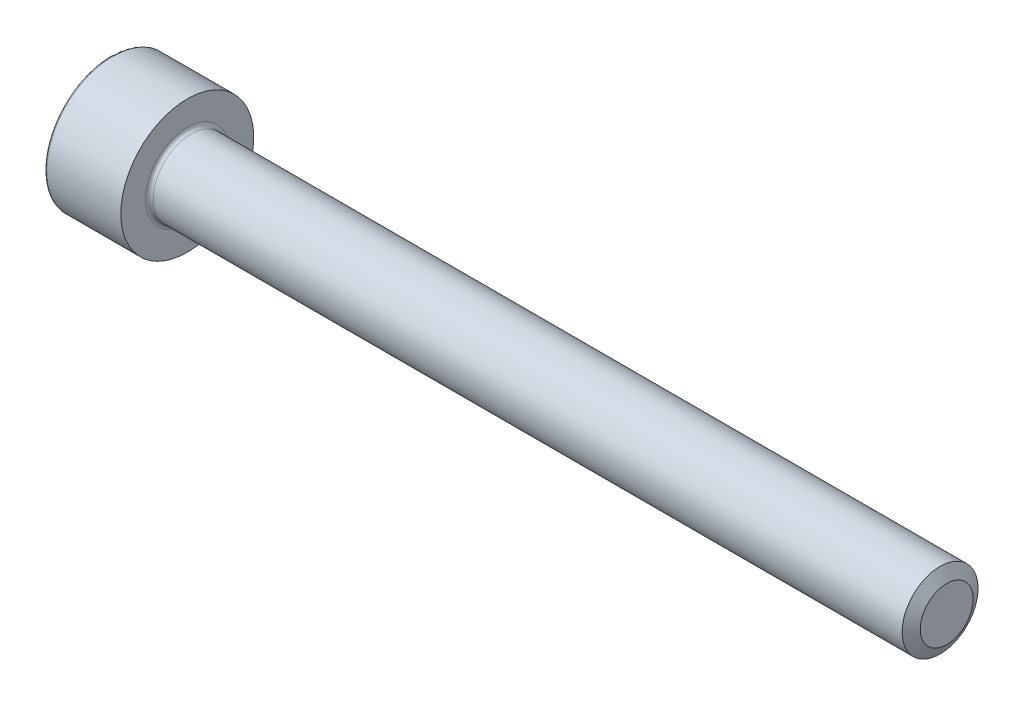
ISO-10303-21;
HEADER;
FILE_DESCRIPTION(('STEP AP214'),'2;1');
FILE_NAME('part.step','',(''),(''),'','','');
FILE_SCHEMA(('AUTOMOTIVE_DESIGN { 1 0 10303 214 1 1 1 1 }'));
ENDSEC;
DATA;
#1=APPLICATION_CONTEXT('core data for automotive mechanical design processes');
#2=APPLICATION_PROTOCOL_DEFINITION('international standard','automotive_design',2000,#1);
#3=PRODUCT_CONTEXT('',#1,'mechanical');
#4=PRODUCT('Part','Part','',(#3));
#5=PRODUCT_RELATED_PRODUCT_CATEGORY('part','',(#4));
#6=PRODUCT_DEFINITION_FORMATION('','',#4);
#7=PRODUCT_DEFINITION_CONTEXT('part definition',#1,'design');
#8=PRODUCT_DEFINITION('design','',#6,#7);
#9=PRODUCT_DEFINITION_SHAPE('','',#8);
#10=(LENGTH_UNIT() NAMED_UNIT(*) SI_UNIT(.MILLI.,.METRE.));
#11=(NAMED_UNIT(*) PLANE_ANGLE_UNIT() SI_UNIT($,.RADIAN.));
#12=(NAMED_UNIT(*) SI_UNIT($,.STERADIAN.) SOLID_ANGLE_UNIT());
#13=UNCERTAINTY_MEASURE_WITH_UNIT(LENGTH_MEASURE(1.E-05),#10,'distance_accuracy_value','');
#14=(GEOMETRIC_REPRESENTATION_CONTEXT(3) GLOBAL_UNCERTAINTY_ASSIGNED_CONTEXT((#13)) GLOBAL_UNIT_ASSIGNED_CONTEXT((#10,
#11,#12)) REPRESENTATION_CONTEXT('',''));
#15=CARTESIAN_POINT('',(0.,0.,0.));
#16=DIRECTION('',(0.,0.,1.));
#17=DIRECTION('',(1.,0.,0.));
#18=AXIS2_PLACEMENT_3D('',#15,#16,#17);
#19=CARTESIAN_POINT('',(0.,0.,0.));
#20=DIRECTION('',(-1.,0.,0.));
#21=DIRECTION('',(0.,0.,1.));
#22=AXIS2_PLACEMENT_3D('',#19,#20,#21);
#23=CYLINDRICAL_SURFACE('',#22,2.);
#24=CARTESIAN_POINT('',(4.2,0.,0.));
#25=DIRECTION('',(-1.,0.,0.));
#26=DIRECTION('',(0.,0.,1.));
#27=AXIS2_PLACEMENT_3D('',#24,#25,#26);
#28=CIRCLE('',#27,2.);
#29=CARTESIAN_POINT('',(4.2,0.,2.));
#30=VERTEX_POINT('',#29);
#31=EDGE_CURVE('E140',#30,#30,#28,.T.);
#32=ORIENTED_EDGE('',*,*,#31,.F.);
#33=EDGE_LOOP('',(#32));
#34=FACE_BOUND('',#33,.T.);
#35=CARTESIAN_POINT('',(43.6500102668172,0.,0.));
#36=DIRECTION('',(-1.,0.,0.));
#37=DIRECTION('',(0.,0.,1.));
#38=AXIS2_PLACEMENT_3D('',#35,#36,#37);
#39=CIRCLE('',#38,2.);
#40=CARTESIAN_POINT('',(43.6500102668172,0.,2.));
#41=VERTEX_POINT('',#40);
#42=EDGE_CURVE('E277',#41,#41,#39,.T.);
#43=ORIENTED_EDGE('',*,*,#42,.T.);
#44=EDGE_LOOP('',(#43));
#45=FACE_BOUND('',#44,.T.);
#46=ADVANCED_FACE('F37',(#34,#45),#23,.T.);
#47=CARTESIAN_POINT('',(0.,0.,0.));
#48=DIRECTION('',(1.,0.,0.));
#49=DIRECTION('',(0.,0.,-1.));
#50=AXIS2_PLACEMENT_3D('',#47,#48,#49);
#51=PLANE('',#50);
#52=CARTESIAN_POINT('',(0.,0.,0.));
#53=DIRECTION('',(1.,0.,0.));
#54=DIRECTION('',(0.,0.,-1.));
#55=AXIS2_PLACEMENT_3D('',#52,#53,#54);
#56=CIRCLE('',#55,3.4);
#57=CARTESIAN_POINT('',(0.,0.,-3.4));
#58=VERTEX_POINT('',#57);
#59=EDGE_CURVE('E45',#58,#58,#56,.F.);
#60=ORIENTED_EDGE('',*,*,#59,.T.);
#61=EDGE_LOOP('',(#60));
#62=FACE_BOUND('',#61,.T.);
#63=DIRECTION('',(0.,0.866025403784438,-0.5));
#64=VECTOR('',#63,1.);
#65=CARTESIAN_POINT('',(0.,0.,1.72));
#66=LINE('',#65,#64);
#67=CARTESIAN_POINT('',(0.,0.,1.72));
#68=VERTEX_POINT('',#67);
#69=CARTESIAN_POINT('',(0.,1.48956369450923,0.859999999999999));
#70=VERTEX_POINT('',#69);
#71=EDGE_CURVE('E126',#68,#70,#66,.T.);
#72=ORIENTED_EDGE('',*,*,#71,.F.);
#73=DIRECTION('',(0.,0.866025403784439,0.5));
#74=VECTOR('',#73,1.);
#75=CARTESIAN_POINT('',(0.,-1.48956369450923,0.86));
#76=LINE('',#75,#74);
#77=CARTESIAN_POINT('',(0.,-1.48956369450923,0.86));
#78=VERTEX_POINT('',#77);
#79=EDGE_CURVE('E52',#78,#68,#76,.T.);
#80=ORIENTED_EDGE('',*,*,#79,.F.);
#81=DIRECTION('',(0.,0.,1.));
#82=VECTOR('',#81,1.);
#83=CARTESIAN_POINT('',(0.,-1.48956369450923,-0.86));
#84=LINE('',#83,#82);
#85=CARTESIAN_POINT('',(0.,-1.48956369450923,-0.86));
#86=VERTEX_POINT('',#85);
#87=EDGE_CURVE('E136',#86,#78,#84,.T.);
#88=ORIENTED_EDGE('',*,*,#87,.F.);
#89=DIRECTION('',(0.,-0.866025403784438,0.5));
#90=VECTOR('',#89,1.);
#91=CARTESIAN_POINT('',(0.,0.,-1.72));
#92=LINE('',#91,#90);
#93=CARTESIAN_POINT('',(0.,0.,-1.72));
#94=VERTEX_POINT('',#93);
#95=EDGE_CURVE('E134',#94,#86,#92,.T.);
#96=ORIENTED_EDGE('',*,*,#95,.F.);
#97=DIRECTION('',(0.,-0.866025403784439,-0.5));
#98=VECTOR('',#97,1.);
#99=CARTESIAN_POINT('',(0.,1.48956369450923,-0.86));
#100=LINE('',#99,#98);
#101=CARTESIAN_POINT('',(0.,1.48956369450923,-0.86));
#102=VERTEX_POINT('',#101);
#103=EDGE_CURVE('E100',#102,#94,#100,.T.);
#104=ORIENTED_EDGE('',*,*,#103,.F.);
#105=DIRECTION('',(0.,0.,-1.));
#106=VECTOR('',#105,1.);
#107=CARTESIAN_POINT('',(0.,1.48956369450923,0.859999999999999));
#108=LINE('',#107,#106);
#109=EDGE_CURVE('E130',#70,#102,#108,.T.);
#110=ORIENTED_EDGE('',*,*,#109,.F.);
#111=EDGE_LOOP('',(#72,#80,#88,#96,#104,#110));
#112=FACE_BOUND('',#111,.T.);
#113=ADVANCED_FACE('F157',(#62,#112),#51,.F.);
#114=CARTESIAN_POINT('',(0.,0.,0.));
#115=DIRECTION('',(-1.,0.,0.));
#116=DIRECTION('',(0.,0.,1.));
#117=AXIS2_PLACEMENT_3D('',#114,#115,#116);
#118=CYLINDRICAL_SURFACE('',#117,3.5);
#119=CARTESIAN_POINT('',(0.1,0.,0.));
#120=DIRECTION('',(1.,0.,0.));
#121=DIRECTION('',(0.,0.,-1.));
#122=AXIS2_PLACEMENT_3D('',#119,#120,#121);
#123=CIRCLE('',#122,3.5);
#124=CARTESIAN_POINT('',(0.1,0.,-3.5));
#125=VERTEX_POINT('',#124);
#126=EDGE_CURVE('E11',#125,#125,#123,.T.);
#127=ORIENTED_EDGE('',*,*,#126,.T.);
#128=EDGE_LOOP('',(#127));
#129=FACE_BOUND('',#128,.T.);
#130=CARTESIAN_POINT('',(4.,0.,0.));
#131=DIRECTION('',(-1.,0.,0.));
#132=DIRECTION('',(0.,0.,1.));
#133=AXIS2_PLACEMENT_3D('',#130,#131,#132);
#134=CIRCLE('',#133,3.5);
#135=CARTESIAN_POINT('',(4.,0.,3.5));
#136=VERTEX_POINT('',#135);
#137=EDGE_CURVE('E151',#136,#136,#134,.T.);
#138=ORIENTED_EDGE('',*,*,#137,.T.);
#139=EDGE_LOOP('',(#138));
#140=FACE_BOUND('',#139,.T.);
#141=ADVANCED_FACE('F176',(#129,#140),#118,.T.);
#142=CARTESIAN_POINT('',(4.,3.5,0.));
#143=DIRECTION('',(-1.,0.,0.));
#144=DIRECTION('',(0.,0.,1.));
#145=AXIS2_PLACEMENT_3D('',#142,#143,#144);
#146=PLANE('',#145);
#147=ORIENTED_EDGE('',*,*,#137,.F.);
#148=EDGE_LOOP('',(#147));
#149=FACE_BOUND('',#148,.T.);
#150=CARTESIAN_POINT('',(4.,0.,0.));
#151=DIRECTION('',(-1.,0.,0.));
#152=DIRECTION('',(0.,0.,1.));
#153=AXIS2_PLACEMENT_3D('',#150,#151,#152);
#154=CIRCLE('',#153,2.2);
#155=CARTESIAN_POINT('',(4.,0.,2.2));
#156=VERTEX_POINT('',#155);
#157=EDGE_CURVE('E148',#156,#156,#154,.T.);
#158=ORIENTED_EDGE('',*,*,#157,.T.);
#159=EDGE_LOOP('',(#158));
#160=FACE_BOUND('',#159,.T.);
#161=ADVANCED_FACE('F185',(#149,#160),#146,.F.);
#162=CARTESIAN_POINT('',(4.2,0.,0.));
#163=DIRECTION('',(-1.,0.,0.));
#164=DIRECTION('',(0.,0.,1.));
#165=AXIS2_PLACEMENT_3D('',#162,#163,#164);
#166=TOROIDAL_SURFACE('',#165,2.2,0.2);
#167=ORIENTED_EDGE('',*,*,#157,.F.);
#168=EDGE_LOOP('',(#167));
#169=FACE_BOUND('',#168,.T.);
#170=ORIENTED_EDGE('',*,*,#31,.T.);
#171=EDGE_LOOP('',(#170));
#172=FACE_BOUND('',#171,.T.);
#173=ADVANCED_FACE('F181',(#169,#172),#166,.F.);
#174=CARTESIAN_POINT('',(2.,-1.48956369450923,0.86));
#175=DIRECTION('',(0.,-0.5,0.866025403784439));
#176=DIRECTION('',(0.,-0.866025403784439,-0.5));
#177=AXIS2_PLACEMENT_3D('',#174,#175,#176);
#178=PLANE('',#177);
#179=ORIENTED_EDGE('',*,*,#79,.T.);
#180=DIRECTION('',(-1.,0.,0.));
#181=VECTOR('',#180,1.);
#182=CARTESIAN_POINT('',(2.,0.,1.72));
#183=LINE('',#182,#181);
#184=CARTESIAN_POINT('',(2.,0.,1.72));
#185=VERTEX_POINT('',#184);
#186=EDGE_CURVE('E82',#185,#68,#183,.T.);
#187=ORIENTED_EDGE('',*,*,#186,.F.);
#188=DIRECTION('',(0.,0.866025403784439,0.5));
#189=VECTOR('',#188,1.);
#190=CARTESIAN_POINT('',(2.,-1.48956369450923,0.86));
#191=LINE('',#190,#189);
#192=CARTESIAN_POINT('',(2.,-1.48956369450923,0.86));
#193=VERTEX_POINT('',#192);
#194=EDGE_CURVE('E138',#193,#185,#191,.T.);
#195=ORIENTED_EDGE('',*,*,#194,.F.);
#196=DIRECTION('',(-1.,0.,0.));
#197=VECTOR('',#196,1.);
#198=CARTESIAN_POINT('',(2.,-1.48956369450923,0.86));
#199=LINE('',#198,#197);
#200=EDGE_CURVE('E60',#193,#78,#199,.T.);
#201=ORIENTED_EDGE('',*,*,#200,.T.);
#202=EDGE_LOOP('',(#179,#187,#195,#201));
#203=FACE_BOUND('',#202,.T.);
#204=ADVANCED_FACE('F184',(#203),#178,.F.);
#205=CARTESIAN_POINT('',(2.,-1.48956369450923,-0.86));
#206=DIRECTION('',(0.,-1.,0.));
#207=DIRECTION('',(0.,0.,-1.));
#208=AXIS2_PLACEMENT_3D('',#205,#206,#207);
#209=PLANE('',#208);
#210=ORIENTED_EDGE('',*,*,#87,.T.);
#211=ORIENTED_EDGE('',*,*,#200,.F.);
#212=DIRECTION('',(0.,0.,1.));
#213=VECTOR('',#212,1.);
#214=CARTESIAN_POINT('',(2.,-1.48956369450923,-0.86));
#215=LINE('',#214,#213);
#216=CARTESIAN_POINT('',(2.,-1.48956369450923,-0.86));
#217=VERTEX_POINT('',#216);
#218=EDGE_CURVE('E112',#217,#193,#215,.T.);
#219=ORIENTED_EDGE('',*,*,#218,.F.);
#220=DIRECTION('',(-1.,0.,0.));
#221=VECTOR('',#220,1.);
#222=CARTESIAN_POINT('',(2.,-1.48956369450923,-0.86));
#223=LINE('',#222,#221);
#224=EDGE_CURVE('E104',#217,#86,#223,.T.);
#225=ORIENTED_EDGE('',*,*,#224,.T.);
#226=EDGE_LOOP('',(#210,#211,#219,#225));
#227=FACE_BOUND('',#226,.T.);
#228=ADVANCED_FACE('F215',(#227),#209,.F.);
#229=CARTESIAN_POINT('',(2.,0.,-1.72));
#230=DIRECTION('',(0.,-0.5,-0.866025403784439));
#231=DIRECTION('',(0.,0.866025403784438,-0.5));
#232=AXIS2_PLACEMENT_3D('',#229,#230,#231);
#233=PLANE('',#232);
#234=ORIENTED_EDGE('',*,*,#95,.T.);
#235=ORIENTED_EDGE('',*,*,#224,.F.);
#236=DIRECTION('',(0.,-0.866025403784438,0.5));
#237=VECTOR('',#236,1.);
#238=CARTESIAN_POINT('',(2.,0.,-1.72));
#239=LINE('',#238,#237);
#240=CARTESIAN_POINT('',(2.,0.,-1.72));
#241=VERTEX_POINT('',#240);
#242=EDGE_CURVE('E108',#241,#217,#239,.T.);
#243=ORIENTED_EDGE('',*,*,#242,.F.);
#244=DIRECTION('',(-1.,0.,0.));
#245=VECTOR('',#244,1.);
#246=CARTESIAN_POINT('',(2.,0.,-1.72));
#247=LINE('',#246,#245);
#248=EDGE_CURVE('E93',#241,#94,#247,.T.);
#249=ORIENTED_EDGE('',*,*,#248,.T.);
#250=EDGE_LOOP('',(#234,#235,#243,#249));
#251=FACE_BOUND('',#250,.T.);
#252=ADVANCED_FACE('F109',(#251),#233,.F.);
#253=CARTESIAN_POINT('',(2.,1.48956369450923,-0.86));
#254=DIRECTION('',(0.,0.5,-0.866025403784439));
#255=DIRECTION('',(0.,0.866025403784439,0.5));
#256=AXIS2_PLACEMENT_3D('',#253,#254,#255);
#257=PLANE('',#256);
#258=ORIENTED_EDGE('',*,*,#103,.T.);
#259=ORIENTED_EDGE('',*,*,#248,.F.);
#260=DIRECTION('',(0.,-0.866025403784439,-0.5));
#261=VECTOR('',#260,1.);
#262=CARTESIAN_POINT('',(2.,1.48956369450923,-0.86));
#263=LINE('',#262,#261);
#264=CARTESIAN_POINT('',(2.,1.48956369450923,-0.86));
#265=VERTEX_POINT('',#264);
#266=EDGE_CURVE('E97',#265,#241,#263,.T.);
#267=ORIENTED_EDGE('',*,*,#266,.F.);
#268=DIRECTION('',(-1.,0.,0.));
#269=VECTOR('',#268,1.);
#270=CARTESIAN_POINT('',(2.,1.48956369450923,-0.86));
#271=LINE('',#270,#269);
#272=EDGE_CURVE('E105',#265,#102,#271,.T.);
#273=ORIENTED_EDGE('',*,*,#272,.T.);
#274=EDGE_LOOP('',(#258,#259,#267,#273));
#275=FACE_BOUND('',#274,.T.);
#276=ADVANCED_FACE('F95',(#275),#257,.F.);
#277=CARTESIAN_POINT('',(2.,1.48956369450923,0.859999999999999));
#278=DIRECTION('',(0.,1.,0.));
#279=DIRECTION('',(0.,0.,1.));
#280=AXIS2_PLACEMENT_3D('',#277,#278,#279);
#281=PLANE('',#280);
#282=ORIENTED_EDGE('',*,*,#109,.T.);
#283=ORIENTED_EDGE('',*,*,#272,.F.);
#284=DIRECTION('',(0.,0.,-1.));
#285=VECTOR('',#284,1.);
#286=CARTESIAN_POINT('',(2.,1.48956369450923,0.859999999999999));
#287=LINE('',#286,#285);
#288=CARTESIAN_POINT('',(2.,1.48956369450923,0.859999999999999));
#289=VERTEX_POINT('',#288);
#290=EDGE_CURVE('E118',#289,#265,#287,.T.);
#291=ORIENTED_EDGE('',*,*,#290,.F.);
#292=DIRECTION('',(-1.,0.,0.));
#293=VECTOR('',#292,1.);
#294=CARTESIAN_POINT('',(2.,1.48956369450923,0.859999999999999));
#295=LINE('',#294,#293);
#296=EDGE_CURVE('E143',#289,#70,#295,.T.);
#297=ORIENTED_EDGE('',*,*,#296,.T.);
#298=EDGE_LOOP('',(#282,#283,#291,#297));
#299=FACE_BOUND('',#298,.T.);
#300=ADVANCED_FACE('F233',(#299),#281,.F.);
#301=CARTESIAN_POINT('',(2.,0.,1.72));
#302=DIRECTION('',(0.,0.5,0.866025403784439));
#303=DIRECTION('',(0.,-0.866025403784438,0.5));
#304=AXIS2_PLACEMENT_3D('',#301,#302,#303);
#305=PLANE('',#304);
#306=ORIENTED_EDGE('',*,*,#71,.T.);
#307=ORIENTED_EDGE('',*,*,#296,.F.);
#308=DIRECTION('',(0.,0.866025403784438,-0.5));
#309=VECTOR('',#308,1.);
#310=CARTESIAN_POINT('',(2.,0.,1.72));
#311=LINE('',#310,#309);
#312=EDGE_CURVE('E120',#185,#289,#311,.T.);
#313=ORIENTED_EDGE('',*,*,#312,.F.);
#314=ORIENTED_EDGE('',*,*,#186,.T.);
#315=EDGE_LOOP('',(#306,#307,#313,#314));
#316=FACE_BOUND('',#315,.T.);
#317=ADVANCED_FACE('F240',(#316),#305,.F.);
#318=CARTESIAN_POINT('',(2.,1.48956369450923,2.58));
#319=DIRECTION('',(-1.,0.,0.));
#320=DIRECTION('',(0.,0.,1.));
#321=AXIS2_PLACEMENT_3D('',#318,#319,#320);
#322=PLANE('',#321);
#323=ORIENTED_EDGE('',*,*,#194,.T.);
#324=ORIENTED_EDGE('',*,*,#312,.T.);
#325=ORIENTED_EDGE('',*,*,#290,.T.);
#326=ORIENTED_EDGE('',*,*,#266,.T.);
#327=ORIENTED_EDGE('',*,*,#242,.T.);
#328=ORIENTED_EDGE('',*,*,#218,.T.);
#329=EDGE_LOOP('',(#323,#324,#325,#326,#327,#328));
#330=FACE_BOUND('',#329,.T.);
#331=ADVANCED_FACE('F115',(#330),#322,.T.);
#332=CARTESIAN_POINT('',(43.6500102668172,0.,0.));
#333=DIRECTION('',(-1.,0.,0.));
#334=DIRECTION('',(0.,0.,1.));
#335=AXIS2_PLACEMENT_3D('',#332,#333,#334);
#336=CONICAL_SURFACE('',#335,2.,1.04719755119659);
#337=CARTESIAN_POINT('',(44.,0.,0.));
#338=DIRECTION('',(-1.,0.,0.));
#339=DIRECTION('',(0.,0.,1.));
#340=AXIS2_PLACEMENT_3D('',#337,#338,#339);
#341=CIRCLE('',#340,1.3938);
#342=CARTESIAN_POINT('',(44.,0.,1.3938));
#343=VERTEX_POINT('',#342);
#344=EDGE_CURVE('E127',#343,#343,#341,.T.);
#345=ORIENTED_EDGE('',*,*,#344,.T.);
#346=EDGE_LOOP('',(#345));
#347=FACE_BOUND('',#346,.T.);
#348=ORIENTED_EDGE('',*,*,#42,.F.);
#349=EDGE_LOOP('',(#348));
#350=FACE_BOUND('',#349,.T.);
#351=ADVANCED_FACE('F166',(#347,#350),#336,.T.);
#352=CARTESIAN_POINT('',(44.,2.,0.));
#353=DIRECTION('',(-1.,0.,0.));
#354=DIRECTION('',(0.,0.,1.));
#355=AXIS2_PLACEMENT_3D('',#352,#353,#354);
#356=PLANE('',#355);
#357=ORIENTED_EDGE('',*,*,#344,.F.);
#358=EDGE_LOOP('',(#357));
#359=FACE_BOUND('',#358,.T.);
#360=ADVANCED_FACE('F161',(#359),#356,.F.);
#361=CARTESIAN_POINT('',(0.1,0.,0.));
#362=DIRECTION('',(1.,0.,0.));
#363=DIRECTION('',(0.,0.,-1.));
#364=AXIS2_PLACEMENT_3D('',#361,#362,#363);
#365=TOROIDAL_SURFACE('',#364,3.4,0.1);
#366=ORIENTED_EDGE('',*,*,#126,.F.);
#367=EDGE_LOOP('',(#366));
#368=FACE_BOUND('',#367,.T.);
#369=ORIENTED_EDGE('',*,*,#59,.F.);
#370=EDGE_LOOP('',(#369));
#371=FACE_BOUND('',#370,.T.);
#372=ADVANCED_FACE('F39',(#368,#371),#365,.T.);
#373=CLOSED_SHELL('',(#46,#113,#141,#161,#173,#204,#228,#252,#276,#300,#317,#331,#351,#360,#372));
#374=MANIFOLD_SOLID_BREP('B2',#373);
#375=ADVANCED_BREP_SHAPE_REPRESENTATION('',(#18,#374),#14);
#376=SHAPE_DEFINITION_REPRESENTATION(#9,#375);
ENDSEC;
END-ISO-10303-21;
